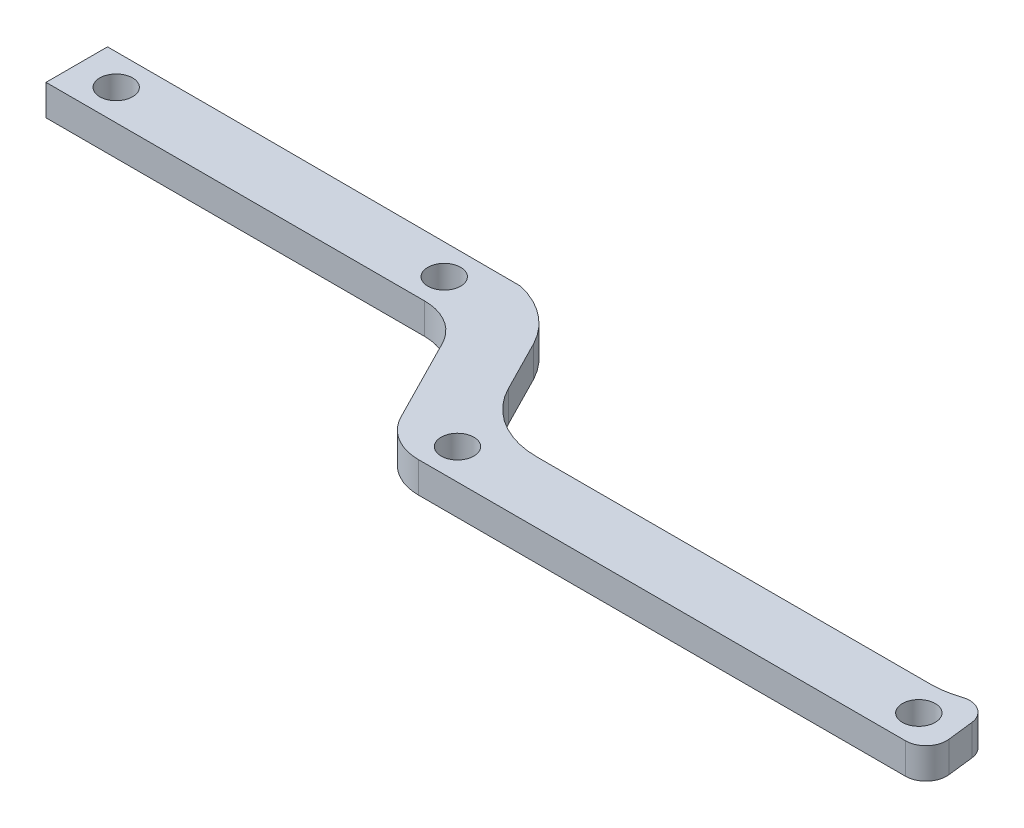
ISO-10303-21;
HEADER;
FILE_DESCRIPTION(('STEP AP214'),'2;1');
FILE_NAME('part.step','',(''),(''),'','','');
FILE_SCHEMA(('AUTOMOTIVE_DESIGN { 1 0 10303 214 1 1 1 1 }'));
ENDSEC;
DATA;
#1=APPLICATION_CONTEXT('core data for automotive mechanical design processes');
#2=APPLICATION_PROTOCOL_DEFINITION('international standard','automotive_design',2000,#1);
#3=PRODUCT_CONTEXT('',#1,'mechanical');
#4=PRODUCT('Part','Part','',(#3));
#5=PRODUCT_RELATED_PRODUCT_CATEGORY('part','',(#4));
#6=PRODUCT_DEFINITION_FORMATION('','',#4);
#7=PRODUCT_DEFINITION_CONTEXT('part definition',#1,'design');
#8=PRODUCT_DEFINITION('design','',#6,#7);
#9=PRODUCT_DEFINITION_SHAPE('','',#8);
#10=(LENGTH_UNIT() NAMED_UNIT(*) SI_UNIT(.MILLI.,.METRE.));
#11=(NAMED_UNIT(*) PLANE_ANGLE_UNIT() SI_UNIT($,.RADIAN.));
#12=(NAMED_UNIT(*) SI_UNIT($,.STERADIAN.) SOLID_ANGLE_UNIT());
#13=UNCERTAINTY_MEASURE_WITH_UNIT(LENGTH_MEASURE(1.E-05),#10,'distance_accuracy_value','');
#14=(GEOMETRIC_REPRESENTATION_CONTEXT(3) GLOBAL_UNCERTAINTY_ASSIGNED_CONTEXT((#13)) GLOBAL_UNIT_ASSIGNED_CONTEXT((#10,
#11,#12)) REPRESENTATION_CONTEXT('',''));
#15=CARTESIAN_POINT('',(0.,0.,0.));
#16=DIRECTION('',(0.,0.,1.));
#17=DIRECTION('',(1.,0.,0.));
#18=AXIS2_PLACEMENT_3D('',#15,#16,#17);
#19=CARTESIAN_POINT('',(-9.79982738187244,3.,48.7042065669143));
#20=DIRECTION('',(0.,-1.,0.));
#21=DIRECTION('',(0.,0.,-1.));
#22=AXIS2_PLACEMENT_3D('',#19,#20,#21);
#23=PLANE('',#22);
#24=CARTESIAN_POINT('',(-56.,3.,37.));
#25=DIRECTION('',(0.,1.,0.));
#26=DIRECTION('',(0.,0.,1.));
#27=AXIS2_PLACEMENT_3D('',#24,#25,#26);
#28=CIRCLE('',#27,1.60000000000001);
#29=CARTESIAN_POINT('',(-56.,3.,38.6));
#30=VERTEX_POINT('',#29);
#31=EDGE_CURVE('E304',#30,#30,#28,.T.);
#32=ORIENTED_EDGE('',*,*,#31,.F.);
#33=EDGE_LOOP('',(#32));
#34=FACE_BOUND('',#33,.T.);
#35=CARTESIAN_POINT('',(-24.,3.,37.));
#36=DIRECTION('',(0.,1.,0.));
#37=DIRECTION('',(0.,0.,1.));
#38=AXIS2_PLACEMENT_3D('',#35,#36,#37);
#39=CIRCLE('',#38,1.6);
#40=CARTESIAN_POINT('',(-24.,3.,38.6));
#41=VERTEX_POINT('',#40);
#42=EDGE_CURVE('E196',#41,#41,#39,.T.);
#43=ORIENTED_EDGE('',*,*,#42,.F.);
#44=EDGE_LOOP('',(#43));
#45=FACE_BOUND('',#44,.T.);
#46=DIRECTION('',(1.,0.,0.));
#47=VECTOR('',#46,1.);
#48=CARTESIAN_POINT('',(-9.79982738187244,3.,53.7042065669143));
#49=LINE('',#48,#47);
#50=CARTESIAN_POINT('',(-9.79982738187244,3.,53.7042065669143));
#51=VERTEX_POINT('',#50);
#52=CARTESIAN_POINT('',(37.7050891937323,3.,53.7042065669143));
#53=VERTEX_POINT('',#52);
#54=EDGE_CURVE('E190',#51,#53,#49,.T.);
#55=ORIENTED_EDGE('',*,*,#54,.T.);
#56=CARTESIAN_POINT('',(37.7050891937323,3.,51.7042065669143));
#57=DIRECTION('',(0.,-1.,0.));
#58=DIRECTION('',(0.,0.,-1.));
#59=AXIS2_PLACEMENT_3D('',#56,#57,#58);
#60=CIRCLE('',#59,2.);
#61=CARTESIAN_POINT('',(39.6914220712851,3.,51.4707934148579));
#62=VERTEX_POINT('',#61);
#63=EDGE_CURVE('E221',#53,#62,#60,.F.);
#64=ORIENTED_EDGE('',*,*,#63,.T.);
#65=DIRECTION('',(0.116706576028239,0.,0.993166438776384));
#66=VECTOR('',#65,1.);
#67=CARTESIAN_POINT('',(39.9148413215952,3.,53.3720787471503));
#68=LINE('',#67,#66);
#69=CARTESIAN_POINT('',(39.3927079930836,3.,48.9287533057557));
#70=VERTEX_POINT('',#69);
#71=EDGE_CURVE('E244',#70,#62,#68,.T.);
#72=ORIENTED_EDGE('',*,*,#71,.F.);
#73=CARTESIAN_POINT('',(37.4063751155308,3.,49.1621664578122));
#74=DIRECTION('',(0.,-1.,0.));
#75=DIRECTION('',(0.,0.,-1.));
#76=AXIS2_PLACEMENT_3D('',#73,#74,#75);
#77=CIRCLE('',#76,2.);
#78=CARTESIAN_POINT('',(36.7582656155353,3.,47.2700898007987));
#79=VERTEX_POINT('',#78);
#80=EDGE_CURVE('E219',#70,#79,#77,.F.);
#81=ORIENTED_EDGE('',*,*,#80,.T.);
#82=CARTESIAN_POINT('',(34.1658276155532,3.,39.7017831727445));
#83=DIRECTION('',(0.,1.,0.));
#84=DIRECTION('',(0.,0.,-1.));
#85=AXIS2_PLACEMENT_3D('',#82,#83,#84);
#86=CIRCLE('',#85,8.00000000000001);
#87=CARTESIAN_POINT('',(34.1658276155532,3.,47.7017831727445));
#88=VERTEX_POINT('',#87);
#89=EDGE_CURVE('E281',#88,#79,#86,.T.);
#90=ORIENTED_EDGE('',*,*,#89,.F.);
#91=DIRECTION('',(1.,0.,0.));
#92=VECTOR('',#91,1.);
#93=CARTESIAN_POINT('',(-4.28585506961672,3.,47.7017831727445));
#94=LINE('',#93,#92);
#95=CARTESIAN_POINT('',(-4.28585506961672,3.,47.7017831727445));
#96=VERTEX_POINT('',#95);
#97=EDGE_CURVE('E279',#96,#88,#94,.T.);
#98=ORIENTED_EDGE('',*,*,#97,.F.);
#99=CARTESIAN_POINT('',(-4.28585506961672,3.,39.7017831727445));
#100=DIRECTION('',(0.,1.,0.));
#101=DIRECTION('',(0.,0.,-1.));
#102=AXIS2_PLACEMENT_3D('',#99,#100,#101);
#103=CIRCLE('',#102,8.);
#104=CARTESIAN_POINT('',(-11.4139072631237,3.,43.3337071706608));
#105=VERTEX_POINT('',#104);
#106=EDGE_CURVE('E277',#105,#96,#103,.T.);
#107=ORIENTED_EDGE('',*,*,#106,.F.);
#108=DIRECTION('',(0.453990499739546,0.,0.891006524188369));
#109=VECTOR('',#108,1.);
#110=CARTESIAN_POINT('',(-13.9886798018229,3.,38.2804315369236));
#111=LINE('',#110,#109);
#112=CARTESIAN_POINT('',(-13.9886798018229,3.,38.2804315369236));
#113=VERTEX_POINT('',#112);
#114=EDGE_CURVE('E274',#113,#105,#111,.T.);
#115=ORIENTED_EDGE('',*,*,#114,.F.);
#116=CARTESIAN_POINT('',(-21.3285940819915,3.,42.1767169110995));
#117=DIRECTION('',(0.,-1.,0.));
#118=DIRECTION('',(0.,0.,-1.));
#119=AXIS2_PLACEMENT_3D('',#116,#117,#118);
#120=CIRCLE('',#119,8.3099567602509);
#121=CARTESIAN_POINT('',(-19.5007730607667,3.,34.0702718411808));
#122=VERTEX_POINT('',#121);
#123=EDGE_CURVE('E272',#122,#113,#120,.T.);
#124=ORIENTED_EDGE('',*,*,#123,.F.);
#125=DIRECTION('',(0.99999716270001,0.,0.00238214019950525));
#126=VECTOR('',#125,1.);
#127=CARTESIAN_POINT('',(-49.0001458571761,3.,34.));
#128=LINE('',#127,#126);
#129=CARTESIAN_POINT('',(-49.0001458571761,3.,34.));
#130=VERTEX_POINT('',#129);
#131=EDGE_CURVE('E170',#130,#122,#128,.T.);
#132=ORIENTED_EDGE('',*,*,#131,.F.);
#133=DIRECTION('',(1.,0.,0.));
#134=VECTOR('',#133,1.);
#135=CARTESIAN_POINT('',(-59.8464733335436,3.,34.));
#136=LINE('',#135,#134);
#137=CARTESIAN_POINT('',(-59.8464733335436,3.,34.));
#138=VERTEX_POINT('',#137);
#139=EDGE_CURVE('E153',#138,#130,#136,.T.);
#140=ORIENTED_EDGE('',*,*,#139,.F.);
#141=DIRECTION('',(0.,0.,1.));
#142=VECTOR('',#141,1.);
#143=CARTESIAN_POINT('',(-59.8464733335436,3.,34.));
#144=LINE('',#143,#142);
#145=CARTESIAN_POINT('',(-59.8464733335436,3.,40.));
#146=VERTEX_POINT('',#145);
#147=EDGE_CURVE('E167',#138,#146,#144,.T.);
#148=ORIENTED_EDGE('',*,*,#147,.T.);
#149=DIRECTION('',(1.,0.,0.));
#150=VECTOR('',#149,1.);
#151=CARTESIAN_POINT('',(-59.8464733335436,3.,40.));
#152=LINE('',#151,#150);
#153=CARTESIAN_POINT('',(-22.9104772742433,3.,40.));
#154=VERTEX_POINT('',#153);
#155=EDGE_CURVE('E175',#146,#154,#152,.T.);
#156=ORIENTED_EDGE('',*,*,#155,.T.);
#157=CARTESIAN_POINT('',(-22.9104772742433,3.,45.));
#158=DIRECTION('',(0.,-1.,0.));
#159=DIRECTION('',(0.,0.,-1.));
#160=AXIS2_PLACEMENT_3D('',#157,#158,#159);
#161=CIRCLE('',#160,5.);
#162=CARTESIAN_POINT('',(-18.4554446533014,3.,42.7300475013023));
#163=VERTEX_POINT('',#162);
#164=EDGE_CURVE('E214',#154,#163,#161,.T.);
#165=ORIENTED_EDGE('',*,*,#164,.T.);
#166=DIRECTION('',(0.453990499739545,0.,0.891006524188369));
#167=VECTOR('',#166,1.);
#168=CARTESIAN_POINT('',(-19.8464733335436,3.,40.));
#169=LINE('',#168,#167);
#170=CARTESIAN_POINT('',(-14.2548600028143,3.,50.9741590656121));
#171=VERTEX_POINT('',#170);
#172=EDGE_CURVE('E178',#163,#171,#169,.T.);
#173=ORIENTED_EDGE('',*,*,#172,.T.);
#174=CARTESIAN_POINT('',(-9.79982738187244,3.,48.7042065669143));
#175=DIRECTION('',(0.,1.,0.));
#176=DIRECTION('',(0.,0.,-1.));
#177=AXIS2_PLACEMENT_3D('',#174,#175,#176);
#178=CIRCLE('',#177,5.);
#179=EDGE_CURVE('E188',#171,#51,#178,.T.);
#180=ORIENTED_EDGE('',*,*,#179,.T.);
#181=EDGE_LOOP('',(#55,#64,#72,#81,#90,#98,#107,#115,#124,#132,#140,#148,#156,#165,#173,#180));
#182=FACE_BOUND('',#181,.T.);
#183=CARTESIAN_POINT('',(-8.99999999999999,3.,50.7042065669143));
#184=DIRECTION('',(0.,1.,0.));
#185=DIRECTION('',(0.,0.,1.));
#186=AXIS2_PLACEMENT_3D('',#183,#184,#185);
#187=CIRCLE('',#186,1.59999999999999);
#188=CARTESIAN_POINT('',(-8.99999999999999,3.,52.3042065669143));
#189=VERTEX_POINT('',#188);
#190=EDGE_CURVE('E266',#189,#189,#187,.T.);
#191=ORIENTED_EDGE('',*,*,#190,.F.);
#192=EDGE_LOOP('',(#191));
#193=FACE_BOUND('',#192,.T.);
#194=CARTESIAN_POINT('',(36.,3.,50.7042065669143));
#195=DIRECTION('',(0.,1.,0.));
#196=DIRECTION('',(0.,0.,1.));
#197=AXIS2_PLACEMENT_3D('',#194,#195,#196);
#198=CIRCLE('',#197,1.6);
#199=CARTESIAN_POINT('',(36.,3.,52.3042065669143));
#200=VERTEX_POINT('',#199);
#201=EDGE_CURVE('E260',#200,#200,#198,.T.);
#202=ORIENTED_EDGE('',*,*,#201,.F.);
#203=EDGE_LOOP('',(#202));
#204=FACE_BOUND('',#203,.T.);
#205=ADVANCED_FACE('F35',(#34,#45,#182,#193,#204),#23,.F.);
#206=CARTESIAN_POINT('',(-9.79982738187244,0.,48.7042065669143));
#207=DIRECTION('',(0.,-1.,0.));
#208=DIRECTION('',(0.,0.,-1.));
#209=AXIS2_PLACEMENT_3D('',#206,#207,#208);
#210=PLANE('',#209);
#211=DIRECTION('',(-0.116706576028239,0.,-0.993166438776384));
#212=VECTOR('',#211,1.);
#213=CARTESIAN_POINT('',(38.6966577597579,0.,43.0054047253447));
#214=LINE('',#213,#212);
#215=CARTESIAN_POINT('',(39.6914220712851,0.,51.4707934148579));
#216=VERTEX_POINT('',#215);
#217=CARTESIAN_POINT('',(39.3927079930836,0.,48.9287533057557));
#218=VERTEX_POINT('',#217);
#219=EDGE_CURVE('E233',#216,#218,#214,.T.);
#220=ORIENTED_EDGE('',*,*,#219,.F.);
#221=CARTESIAN_POINT('',(37.7050891937323,0.,51.7042065669143));
#222=DIRECTION('',(0.,-1.,0.));
#223=DIRECTION('',(0.,0.,-1.));
#224=AXIS2_PLACEMENT_3D('',#221,#222,#223);
#225=CIRCLE('',#224,2.);
#226=CARTESIAN_POINT('',(37.7050891937323,0.,53.7042065669143));
#227=VERTEX_POINT('',#226);
#228=EDGE_CURVE('E43',#216,#227,#225,.T.);
#229=ORIENTED_EDGE('',*,*,#228,.T.);
#230=DIRECTION('',(1.,0.,0.));
#231=VECTOR('',#230,1.);
#232=CARTESIAN_POINT('',(-9.79982738187244,0.,53.7042065669143));
#233=LINE('',#232,#231);
#234=CARTESIAN_POINT('',(-9.79982738187244,0.,53.7042065669143));
#235=VERTEX_POINT('',#234);
#236=EDGE_CURVE('E176',#235,#227,#233,.T.);
#237=ORIENTED_EDGE('',*,*,#236,.F.);
#238=CARTESIAN_POINT('',(-9.79982738187244,0.,48.7042065669143));
#239=DIRECTION('',(0.,1.,0.));
#240=DIRECTION('',(0.,0.,-1.));
#241=AXIS2_PLACEMENT_3D('',#238,#239,#240);
#242=CIRCLE('',#241,5.);
#243=CARTESIAN_POINT('',(-14.2548600028143,0.,50.9741590656121));
#244=VERTEX_POINT('',#243);
#245=EDGE_CURVE('E181',#244,#235,#242,.T.);
#246=ORIENTED_EDGE('',*,*,#245,.F.);
#247=DIRECTION('',(0.453990499739545,0.,0.891006524188369));
#248=VECTOR('',#247,1.);
#249=CARTESIAN_POINT('',(-19.8464733335436,0.,40.));
#250=LINE('',#249,#248);
#251=CARTESIAN_POINT('',(-18.4554446533014,0.,42.7300475013023));
#252=VERTEX_POINT('',#251);
#253=EDGE_CURVE('E199',#252,#244,#250,.T.);
#254=ORIENTED_EDGE('',*,*,#253,.F.);
#255=CARTESIAN_POINT('',(-22.9104772742433,0.,45.));
#256=DIRECTION('',(0.,-1.,0.));
#257=DIRECTION('',(0.,0.,-1.));
#258=AXIS2_PLACEMENT_3D('',#255,#256,#257);
#259=CIRCLE('',#258,5.);
#260=CARTESIAN_POINT('',(-22.9104772742433,0.,40.));
#261=VERTEX_POINT('',#260);
#262=EDGE_CURVE('E212',#252,#261,#259,.F.);
#263=ORIENTED_EDGE('',*,*,#262,.T.);
#264=DIRECTION('',(1.,0.,0.));
#265=VECTOR('',#264,1.);
#266=CARTESIAN_POINT('',(-59.8464733335436,0.,40.));
#267=LINE('',#266,#265);
#268=CARTESIAN_POINT('',(-59.8464733335436,0.,40.));
#269=VERTEX_POINT('',#268);
#270=EDGE_CURVE('E195',#269,#261,#267,.T.);
#271=ORIENTED_EDGE('',*,*,#270,.F.);
#272=DIRECTION('',(0.,0.,1.));
#273=VECTOR('',#272,1.);
#274=CARTESIAN_POINT('',(-59.8464733335436,0.,34.));
#275=LINE('',#274,#273);
#276=CARTESIAN_POINT('',(-59.8464733335436,0.,34.));
#277=VERTEX_POINT('',#276);
#278=EDGE_CURVE('E193',#277,#269,#275,.T.);
#279=ORIENTED_EDGE('',*,*,#278,.F.);
#280=DIRECTION('',(-1.,0.,0.));
#281=VECTOR('',#280,1.);
#282=CARTESIAN_POINT('',(-9.79982738187244,0.,34.));
#283=LINE('',#282,#281);
#284=CARTESIAN_POINT('',(-49.0001458571761,0.,34.));
#285=VERTEX_POINT('',#284);
#286=EDGE_CURVE('E156',#285,#277,#283,.T.);
#287=ORIENTED_EDGE('',*,*,#286,.F.);
#288=DIRECTION('',(-0.99999716270001,0.,-0.00238214019950525));
#289=VECTOR('',#288,1.);
#290=CARTESIAN_POINT('',(-9.76502244550191,0.,34.0934638298964));
#291=LINE('',#290,#289);
#292=CARTESIAN_POINT('',(-19.5007730607667,0.,34.0702718411808));
#293=VERTEX_POINT('',#292);
#294=EDGE_CURVE('E255',#293,#285,#291,.T.);
#295=ORIENTED_EDGE('',*,*,#294,.F.);
#296=CARTESIAN_POINT('',(-21.3285940819915,0.,42.1767169110995));
#297=DIRECTION('',(0.,-1.,0.));
#298=DIRECTION('',(0.,0.,-1.));
#299=AXIS2_PLACEMENT_3D('',#296,#297,#298);
#300=CIRCLE('',#299,8.3099567602509);
#301=CARTESIAN_POINT('',(-13.9886798018229,0.,38.2804315369236));
#302=VERTEX_POINT('',#301);
#303=EDGE_CURVE('E269',#293,#302,#300,.T.);
#304=ORIENTED_EDGE('',*,*,#303,.T.);
#305=DIRECTION('',(0.453990499739546,0.,0.891006524188369));
#306=VECTOR('',#305,1.);
#307=CARTESIAN_POINT('',(-13.9886798018229,0.,38.2804315369236));
#308=LINE('',#307,#306);
#309=CARTESIAN_POINT('',(-11.4139072631237,0.,43.3337071706608));
#310=VERTEX_POINT('',#309);
#311=EDGE_CURVE('E285',#302,#310,#308,.T.);
#312=ORIENTED_EDGE('',*,*,#311,.T.);
#313=CARTESIAN_POINT('',(-4.28585506961672,0.,39.7017831727445));
#314=DIRECTION('',(0.,1.,0.));
#315=DIRECTION('',(0.,0.,-1.));
#316=AXIS2_PLACEMENT_3D('',#313,#314,#315);
#317=CIRCLE('',#316,8.);
#318=CARTESIAN_POINT('',(-4.28585506961672,0.,47.7017831727445));
#319=VERTEX_POINT('',#318);
#320=EDGE_CURVE('E288',#310,#319,#317,.T.);
#321=ORIENTED_EDGE('',*,*,#320,.T.);
#322=DIRECTION('',(1.,0.,0.));
#323=VECTOR('',#322,1.);
#324=CARTESIAN_POINT('',(-4.28585506961672,0.,47.7017831727445));
#325=LINE('',#324,#323);
#326=CARTESIAN_POINT('',(34.1658276155532,0.,47.7017831727445));
#327=VERTEX_POINT('',#326);
#328=EDGE_CURVE('E291',#319,#327,#325,.T.);
#329=ORIENTED_EDGE('',*,*,#328,.T.);
#330=CARTESIAN_POINT('',(34.1658276155532,0.,39.7017831727445));
#331=DIRECTION('',(0.,1.,0.));
#332=DIRECTION('',(0.,0.,-1.));
#333=AXIS2_PLACEMENT_3D('',#330,#331,#332);
#334=CIRCLE('',#333,8.00000000000001);
#335=CARTESIAN_POINT('',(36.7582656155353,0.,47.2700898007987));
#336=VERTEX_POINT('',#335);
#337=EDGE_CURVE('E275',#327,#336,#334,.T.);
#338=ORIENTED_EDGE('',*,*,#337,.T.);
#339=CARTESIAN_POINT('',(37.4063751155308,0.,49.1621664578122));
#340=DIRECTION('',(0.,-1.,0.));
#341=DIRECTION('',(0.,0.,-1.));
#342=AXIS2_PLACEMENT_3D('',#339,#340,#341);
#343=CIRCLE('',#342,2.);
#344=EDGE_CURVE('E55',#336,#218,#343,.T.);
#345=ORIENTED_EDGE('',*,*,#344,.T.);
#346=EDGE_LOOP('',(#220,#229,#237,#246,#254,#263,#271,#279,#287,#295,#304,#312,#321,#329,#338,#345));
#347=FACE_BOUND('',#346,.T.);
#348=CARTESIAN_POINT('',(36.,0.,50.7042065669143));
#349=DIRECTION('',(0.,1.,0.));
#350=DIRECTION('',(0.,0.,1.));
#351=AXIS2_PLACEMENT_3D('',#348,#349,#350);
#352=CIRCLE('',#351,1.6);
#353=CARTESIAN_POINT('',(36.,0.,52.3042065669143));
#354=VERTEX_POINT('',#353);
#355=EDGE_CURVE('E259',#354,#354,#352,.T.);
#356=ORIENTED_EDGE('',*,*,#355,.T.);
#357=EDGE_LOOP('',(#356));
#358=FACE_BOUND('',#357,.T.);
#359=CARTESIAN_POINT('',(-56.,0.,37.));
#360=DIRECTION('',(0.,1.,0.));
#361=DIRECTION('',(0.,0.,1.));
#362=AXIS2_PLACEMENT_3D('',#359,#360,#361);
#363=CIRCLE('',#362,1.60000000000001);
#364=CARTESIAN_POINT('',(-56.,0.,38.6));
#365=VERTEX_POINT('',#364);
#366=EDGE_CURVE('E303',#365,#365,#363,.T.);
#367=ORIENTED_EDGE('',*,*,#366,.T.);
#368=EDGE_LOOP('',(#367));
#369=FACE_BOUND('',#368,.T.);
#370=CARTESIAN_POINT('',(-24.,0.,37.));
#371=DIRECTION('',(0.,1.,0.));
#372=DIRECTION('',(0.,0.,1.));
#373=AXIS2_PLACEMENT_3D('',#370,#371,#372);
#374=CIRCLE('',#373,1.6);
#375=CARTESIAN_POINT('',(-24.,0.,38.6));
#376=VERTEX_POINT('',#375);
#377=EDGE_CURVE('E184',#376,#376,#374,.T.);
#378=ORIENTED_EDGE('',*,*,#377,.T.);
#379=EDGE_LOOP('',(#378));
#380=FACE_BOUND('',#379,.T.);
#381=CARTESIAN_POINT('',(-8.99999999999999,0.,50.7042065669143));
#382=DIRECTION('',(0.,1.,0.));
#383=DIRECTION('',(0.,0.,1.));
#384=AXIS2_PLACEMENT_3D('',#381,#382,#383);
#385=CIRCLE('',#384,1.59999999999999);
#386=CARTESIAN_POINT('',(-8.99999999999999,0.,52.3042065669143));
#387=VERTEX_POINT('',#386);
#388=EDGE_CURVE('E263',#387,#387,#385,.T.);
#389=ORIENTED_EDGE('',*,*,#388,.T.);
#390=EDGE_LOOP('',(#389));
#391=FACE_BOUND('',#390,.T.);
#392=ADVANCED_FACE('F230',(#347,#358,#369,#380,#391),#210,.T.);
#393=CARTESIAN_POINT('',(-59.8464733335436,3.,34.));
#394=DIRECTION('',(1.,0.,0.));
#395=DIRECTION('',(0.,0.,-1.));
#396=AXIS2_PLACEMENT_3D('',#393,#394,#395);
#397=PLANE('',#396);
#398=ORIENTED_EDGE('',*,*,#278,.T.);
#399=DIRECTION('',(0.,-1.,0.));
#400=VECTOR('',#399,1.);
#401=CARTESIAN_POINT('',(-59.8464733335436,3.,40.));
#402=LINE('',#401,#400);
#403=EDGE_CURVE('E161',#146,#269,#402,.T.);
#404=ORIENTED_EDGE('',*,*,#403,.F.);
#405=ORIENTED_EDGE('',*,*,#147,.F.);
#406=DIRECTION('',(0.,-1.,0.));
#407=VECTOR('',#406,1.);
#408=CARTESIAN_POINT('',(-59.8464733335436,3.,34.));
#409=LINE('',#408,#407);
#410=EDGE_CURVE('E149',#138,#277,#409,.T.);
#411=ORIENTED_EDGE('',*,*,#410,.T.);
#412=EDGE_LOOP('',(#398,#404,#405,#411));
#413=FACE_BOUND('',#412,.T.);
#414=ADVANCED_FACE('F172',(#413),#397,.F.);
#415=CARTESIAN_POINT('',(-59.8464733335436,3.,40.));
#416=DIRECTION('',(0.,0.,-1.));
#417=DIRECTION('',(-1.,0.,0.));
#418=AXIS2_PLACEMENT_3D('',#415,#416,#417);
#419=PLANE('',#418);
#420=ORIENTED_EDGE('',*,*,#270,.T.);
#421=DIRECTION('',(0.,-1.,0.));
#422=VECTOR('',#421,1.);
#423=CARTESIAN_POINT('',(-22.9104772742433,3.,40.));
#424=LINE('',#423,#422);
#425=EDGE_CURVE('E210',#261,#154,#424,.F.);
#426=ORIENTED_EDGE('',*,*,#425,.T.);
#427=ORIENTED_EDGE('',*,*,#155,.F.);
#428=ORIENTED_EDGE('',*,*,#403,.T.);
#429=EDGE_LOOP('',(#420,#426,#427,#428));
#430=FACE_BOUND('',#429,.T.);
#431=ADVANCED_FACE('F345',(#430),#419,.F.);
#432=CARTESIAN_POINT('',(-19.8464733335436,3.,40.));
#433=DIRECTION('',(0.891006524188369,0.,-0.453990499739545));
#434=DIRECTION('',(-0.453990499739545,0.,-0.891006524188369));
#435=AXIS2_PLACEMENT_3D('',#432,#433,#434);
#436=PLANE('',#435);
#437=ORIENTED_EDGE('',*,*,#172,.F.);
#438=DIRECTION('',(0.,-1.,0.));
#439=VECTOR('',#438,1.);
#440=CARTESIAN_POINT('',(-18.4554446533014,0.,42.7300475013023));
#441=LINE('',#440,#439);
#442=EDGE_CURVE('E160',#163,#252,#441,.T.);
#443=ORIENTED_EDGE('',*,*,#442,.T.);
#444=ORIENTED_EDGE('',*,*,#253,.T.);
#445=DIRECTION('',(0.,-1.,0.));
#446=VECTOR('',#445,1.);
#447=CARTESIAN_POINT('',(-14.2548600028143,3.,50.9741590656121));
#448=LINE('',#447,#446);
#449=EDGE_CURVE('E204',#171,#244,#448,.T.);
#450=ORIENTED_EDGE('',*,*,#449,.F.);
#451=EDGE_LOOP('',(#437,#443,#444,#450));
#452=FACE_BOUND('',#451,.T.);
#453=ADVANCED_FACE('F341',(#452),#436,.F.);
#454=CARTESIAN_POINT('',(-9.79982738187244,3.,48.7042065669143));
#455=DIRECTION('',(0.,-1.,0.));
#456=DIRECTION('',(0.,0.,-1.));
#457=AXIS2_PLACEMENT_3D('',#454,#455,#456);
#458=CYLINDRICAL_SURFACE('',#457,5.);
#459=ORIENTED_EDGE('',*,*,#245,.T.);
#460=DIRECTION('',(0.,-1.,0.));
#461=VECTOR('',#460,1.);
#462=CARTESIAN_POINT('',(-9.79982738187244,3.,53.7042065669143));
#463=LINE('',#462,#461);
#464=EDGE_CURVE('E192',#51,#235,#463,.T.);
#465=ORIENTED_EDGE('',*,*,#464,.F.);
#466=ORIENTED_EDGE('',*,*,#179,.F.);
#467=ORIENTED_EDGE('',*,*,#449,.T.);
#468=EDGE_LOOP('',(#459,#465,#466,#467));
#469=FACE_BOUND('',#468,.T.);
#470=ADVANCED_FACE('F327',(#469),#458,.T.);
#471=CARTESIAN_POINT('',(-9.79982738187244,3.,53.7042065669143));
#472=DIRECTION('',(0.,0.,-1.));
#473=DIRECTION('',(-1.,0.,0.));
#474=AXIS2_PLACEMENT_3D('',#471,#472,#473);
#475=PLANE('',#474);
#476=ORIENTED_EDGE('',*,*,#236,.T.);
#477=DIRECTION('',(0.,1.,0.));
#478=VECTOR('',#477,1.);
#479=CARTESIAN_POINT('',(37.7050891937323,3.,53.7042065669143));
#480=LINE('',#479,#478);
#481=EDGE_CURVE('E216',#227,#53,#480,.T.);
#482=ORIENTED_EDGE('',*,*,#481,.T.);
#483=ORIENTED_EDGE('',*,*,#54,.F.);
#484=ORIENTED_EDGE('',*,*,#464,.T.);
#485=EDGE_LOOP('',(#476,#482,#483,#484));
#486=FACE_BOUND('',#485,.T.);
#487=ADVANCED_FACE('F238',(#486),#475,.F.);
#488=CARTESIAN_POINT('',(-24.,3.,37.));
#489=DIRECTION('',(0.,-1.,0.));
#490=DIRECTION('',(0.,0.,-1.));
#491=AXIS2_PLACEMENT_3D('',#488,#489,#490);
#492=CYLINDRICAL_SURFACE('',#491,1.6);
#493=ORIENTED_EDGE('',*,*,#42,.T.);
#494=EDGE_LOOP('',(#493));
#495=FACE_BOUND('',#494,.T.);
#496=ORIENTED_EDGE('',*,*,#377,.F.);
#497=EDGE_LOOP('',(#496));
#498=FACE_BOUND('',#497,.T.);
#499=ADVANCED_FACE('F316',(#495,#498),#492,.F.);
#500=CARTESIAN_POINT('',(-56.,3.,37.));
#501=DIRECTION('',(0.,-1.,0.));
#502=DIRECTION('',(0.,0.,-1.));
#503=AXIS2_PLACEMENT_3D('',#500,#501,#502);
#504=CYLINDRICAL_SURFACE('',#503,1.60000000000001);
#505=ORIENTED_EDGE('',*,*,#31,.T.);
#506=EDGE_LOOP('',(#505));
#507=FACE_BOUND('',#506,.T.);
#508=ORIENTED_EDGE('',*,*,#366,.F.);
#509=EDGE_LOOP('',(#508));
#510=FACE_BOUND('',#509,.T.);
#511=ADVANCED_FACE('F318',(#507,#510),#504,.F.);
#512=CARTESIAN_POINT('',(-21.3285940819915,3.,42.1767169110995));
#513=DIRECTION('',(0.,-1.,0.));
#514=DIRECTION('',(0.,0.,-1.));
#515=AXIS2_PLACEMENT_3D('',#512,#513,#514);
#516=CYLINDRICAL_SURFACE('',#515,8.3099567602509);
#517=DIRECTION('',(0.,-1.,0.));
#518=VECTOR('',#517,1.);
#519=CARTESIAN_POINT('',(-19.5007730607667,3.,34.0702718411808));
#520=LINE('',#519,#518);
#521=EDGE_CURVE('E250',#122,#293,#520,.T.);
#522=ORIENTED_EDGE('',*,*,#521,.F.);
#523=ORIENTED_EDGE('',*,*,#123,.T.);
#524=DIRECTION('',(0.,-1.,0.));
#525=VECTOR('',#524,1.);
#526=CARTESIAN_POINT('',(-13.9886798018229,3.,38.2804315369236));
#527=LINE('',#526,#525);
#528=EDGE_CURVE('E300',#113,#302,#527,.T.);
#529=ORIENTED_EDGE('',*,*,#528,.T.);
#530=ORIENTED_EDGE('',*,*,#303,.F.);
#531=EDGE_LOOP('',(#522,#523,#529,#530));
#532=FACE_BOUND('',#531,.T.);
#533=ADVANCED_FACE('F324',(#532),#516,.T.);
#534=CARTESIAN_POINT('',(-13.9886798018229,3.,38.2804315369236));
#535=DIRECTION('',(0.891006524188368,0.,-0.453990499739546));
#536=DIRECTION('',(-0.453990499739546,0.,-0.891006524188369));
#537=AXIS2_PLACEMENT_3D('',#534,#535,#536);
#538=PLANE('',#537);
#539=ORIENTED_EDGE('',*,*,#311,.F.);
#540=ORIENTED_EDGE('',*,*,#528,.F.);
#541=ORIENTED_EDGE('',*,*,#114,.T.);
#542=DIRECTION('',(0.,-1.,0.));
#543=VECTOR('',#542,1.);
#544=CARTESIAN_POINT('',(-11.4139072631237,3.,43.3337071706608));
#545=LINE('',#544,#543);
#546=EDGE_CURVE('E298',#105,#310,#545,.T.);
#547=ORIENTED_EDGE('',*,*,#546,.T.);
#548=EDGE_LOOP('',(#539,#540,#541,#547));
#549=FACE_BOUND('',#548,.T.);
#550=ADVANCED_FACE('F388',(#549),#538,.T.);
#551=CARTESIAN_POINT('',(-4.28585506961672,3.,39.7017831727445));
#552=DIRECTION('',(0.,-1.,0.));
#553=DIRECTION('',(0.,0.,-1.));
#554=AXIS2_PLACEMENT_3D('',#551,#552,#553);
#555=CYLINDRICAL_SURFACE('',#554,8.);
#556=ORIENTED_EDGE('',*,*,#320,.F.);
#557=ORIENTED_EDGE('',*,*,#546,.F.);
#558=ORIENTED_EDGE('',*,*,#106,.T.);
#559=DIRECTION('',(0.,-1.,0.));
#560=VECTOR('',#559,1.);
#561=CARTESIAN_POINT('',(-4.28585506961672,3.,47.7017831727445));
#562=LINE('',#561,#560);
#563=EDGE_CURVE('E296',#96,#319,#562,.T.);
#564=ORIENTED_EDGE('',*,*,#563,.T.);
#565=EDGE_LOOP('',(#556,#557,#558,#564));
#566=FACE_BOUND('',#565,.T.);
#567=ADVANCED_FACE('F384',(#566),#555,.F.);
#568=CARTESIAN_POINT('',(-4.28585506961672,3.,47.7017831727445));
#569=DIRECTION('',(0.,0.,-1.));
#570=DIRECTION('',(-1.,0.,0.));
#571=AXIS2_PLACEMENT_3D('',#568,#569,#570);
#572=PLANE('',#571);
#573=ORIENTED_EDGE('',*,*,#328,.F.);
#574=ORIENTED_EDGE('',*,*,#563,.F.);
#575=ORIENTED_EDGE('',*,*,#97,.T.);
#576=DIRECTION('',(0.,-1.,0.));
#577=VECTOR('',#576,1.);
#578=CARTESIAN_POINT('',(34.1658276155532,3.,47.7017831727445));
#579=LINE('',#578,#577);
#580=EDGE_CURVE('E283',#88,#327,#579,.T.);
#581=ORIENTED_EDGE('',*,*,#580,.T.);
#582=EDGE_LOOP('',(#573,#574,#575,#581));
#583=FACE_BOUND('',#582,.T.);
#584=ADVANCED_FACE('F381',(#583),#572,.T.);
#585=CARTESIAN_POINT('',(34.1658276155532,3.,39.7017831727445));
#586=DIRECTION('',(0.,-1.,0.));
#587=DIRECTION('',(0.,0.,-1.));
#588=AXIS2_PLACEMENT_3D('',#585,#586,#587);
#589=CYLINDRICAL_SURFACE('',#588,8.00000000000001);
#590=ORIENTED_EDGE('',*,*,#89,.T.);
#591=DIRECTION('',(0.,-1.,0.));
#592=VECTOR('',#591,1.);
#593=CARTESIAN_POINT('',(36.7582656155353,3.,47.2700898007987));
#594=LINE('',#593,#592);
#595=EDGE_CURVE('E11',#79,#336,#594,.T.);
#596=ORIENTED_EDGE('',*,*,#595,.T.);
#597=ORIENTED_EDGE('',*,*,#337,.F.);
#598=ORIENTED_EDGE('',*,*,#580,.F.);
#599=EDGE_LOOP('',(#590,#596,#597,#598));
#600=FACE_BOUND('',#599,.T.);
#601=ADVANCED_FACE('F377',(#600),#589,.F.);
#602=CARTESIAN_POINT('',(-8.99999999999999,3.,50.7042065669143));
#603=DIRECTION('',(0.,-1.,0.));
#604=DIRECTION('',(0.,0.,-1.));
#605=AXIS2_PLACEMENT_3D('',#602,#603,#604);
#606=CYLINDRICAL_SURFACE('',#605,1.59999999999999);
#607=ORIENTED_EDGE('',*,*,#190,.T.);
#608=EDGE_LOOP('',(#607));
#609=FACE_BOUND('',#608,.T.);
#610=ORIENTED_EDGE('',*,*,#388,.F.);
#611=EDGE_LOOP('',(#610));
#612=FACE_BOUND('',#611,.T.);
#613=ADVANCED_FACE('F373',(#609,#612),#606,.F.);
#614=CARTESIAN_POINT('',(36.,3.,50.7042065669143));
#615=DIRECTION('',(0.,-1.,0.));
#616=DIRECTION('',(0.,0.,-1.));
#617=AXIS2_PLACEMENT_3D('',#614,#615,#616);
#618=CYLINDRICAL_SURFACE('',#617,1.6);
#619=ORIENTED_EDGE('',*,*,#201,.T.);
#620=EDGE_LOOP('',(#619));
#621=FACE_BOUND('',#620,.T.);
#622=ORIENTED_EDGE('',*,*,#355,.F.);
#623=EDGE_LOOP('',(#622));
#624=FACE_BOUND('',#623,.T.);
#625=ADVANCED_FACE('F354',(#621,#624),#618,.F.);
#626=CARTESIAN_POINT('',(-22.9104772742433,3.,45.));
#627=DIRECTION('',(0.,1.,0.));
#628=DIRECTION('',(0.,0.,1.));
#629=AXIS2_PLACEMENT_3D('',#626,#627,#628);
#630=CYLINDRICAL_SURFACE('',#629,5.);
#631=ORIENTED_EDGE('',*,*,#164,.F.);
#632=ORIENTED_EDGE('',*,*,#425,.F.);
#633=ORIENTED_EDGE('',*,*,#262,.F.);
#634=ORIENTED_EDGE('',*,*,#442,.F.);
#635=EDGE_LOOP('',(#631,#632,#633,#634));
#636=FACE_BOUND('',#635,.T.);
#637=ADVANCED_FACE('F352',(#636),#630,.F.);
#638=CARTESIAN_POINT('',(39.9148413215952,-9.,53.3720787471503));
#639=DIRECTION('',(-0.993166438776384,0.,0.116706576028239));
#640=DIRECTION('',(0.116706576028239,0.,0.993166438776384));
#641=AXIS2_PLACEMENT_3D('',#638,#639,#640);
#642=PLANE('',#641);
#643=ORIENTED_EDGE('',*,*,#71,.T.);
#644=DIRECTION('',(0.,1.,0.));
#645=VECTOR('',#644,1.);
#646=CARTESIAN_POINT('',(39.6914220712851,-9.,51.4707934148579));
#647=LINE('',#646,#645);
#648=EDGE_CURVE('E226',#62,#216,#647,.F.);
#649=ORIENTED_EDGE('',*,*,#648,.T.);
#650=ORIENTED_EDGE('',*,*,#219,.T.);
#651=DIRECTION('',(0.,1.,0.));
#652=VECTOR('',#651,1.);
#653=CARTESIAN_POINT('',(39.3927079930836,3.,48.9287533057557));
#654=LINE('',#653,#652);
#655=EDGE_CURVE('E223',#218,#70,#654,.T.);
#656=ORIENTED_EDGE('',*,*,#655,.T.);
#657=EDGE_LOOP('',(#643,#649,#650,#656));
#658=FACE_BOUND('',#657,.T.);
#659=ADVANCED_FACE('F246',(#658),#642,.F.);
#660=CARTESIAN_POINT('',(-49.0001458571761,-9.,34.));
#661=DIRECTION('',(-0.00238214019950525,0.,0.99999716270001));
#662=DIRECTION('',(0.99999716270001,0.,0.00238214019950525));
#663=AXIS2_PLACEMENT_3D('',#660,#661,#662);
#664=PLANE('',#663);
#665=ORIENTED_EDGE('',*,*,#294,.T.);
#666=DIRECTION('',(0.,1.,0.));
#667=VECTOR('',#666,1.);
#668=CARTESIAN_POINT('',(-49.0001458571761,-9.,34.));
#669=LINE('',#668,#667);
#670=EDGE_CURVE('E248',#285,#130,#669,.T.);
#671=ORIENTED_EDGE('',*,*,#670,.T.);
#672=ORIENTED_EDGE('',*,*,#131,.T.);
#673=ORIENTED_EDGE('',*,*,#521,.T.);
#674=EDGE_LOOP('',(#665,#671,#672,#673));
#675=FACE_BOUND('',#674,.T.);
#676=ADVANCED_FACE('F362',(#675),#664,.F.);
#677=CARTESIAN_POINT('',(-59.8464733335436,-9.,34.));
#678=DIRECTION('',(0.,0.,1.));
#679=DIRECTION('',(1.,0.,0.));
#680=AXIS2_PLACEMENT_3D('',#677,#678,#679);
#681=PLANE('',#680);
#682=ORIENTED_EDGE('',*,*,#286,.T.);
#683=ORIENTED_EDGE('',*,*,#410,.F.);
#684=ORIENTED_EDGE('',*,*,#139,.T.);
#685=ORIENTED_EDGE('',*,*,#670,.F.);
#686=EDGE_LOOP('',(#682,#683,#684,#685));
#687=FACE_BOUND('',#686,.T.);
#688=ADVANCED_FACE('F151',(#687),#681,.F.);
#689=CARTESIAN_POINT('',(37.7050891937323,3.,51.7042065669143));
#690=DIRECTION('',(0.,1.,0.));
#691=DIRECTION('',(0.,0.,1.));
#692=AXIS2_PLACEMENT_3D('',#689,#690,#691);
#693=CYLINDRICAL_SURFACE('',#692,2.);
#694=ORIENTED_EDGE('',*,*,#228,.F.);
#695=ORIENTED_EDGE('',*,*,#648,.F.);
#696=ORIENTED_EDGE('',*,*,#63,.F.);
#697=ORIENTED_EDGE('',*,*,#481,.F.);
#698=EDGE_LOOP('',(#694,#695,#696,#697));
#699=FACE_BOUND('',#698,.T.);
#700=ADVANCED_FACE('F241',(#699),#693,.T.);
#701=CARTESIAN_POINT('',(37.4063751155308,3.,49.1621664578122));
#702=DIRECTION('',(0.,-1.,0.));
#703=DIRECTION('',(0.,0.,-1.));
#704=AXIS2_PLACEMENT_3D('',#701,#702,#703);
#705=CYLINDRICAL_SURFACE('',#704,2.);
#706=ORIENTED_EDGE('',*,*,#344,.F.);
#707=ORIENTED_EDGE('',*,*,#595,.F.);
#708=ORIENTED_EDGE('',*,*,#80,.F.);
#709=ORIENTED_EDGE('',*,*,#655,.F.);
#710=EDGE_LOOP('',(#706,#707,#708,#709));
#711=FACE_BOUND('',#710,.T.);
#712=ADVANCED_FACE('F37',(#711),#705,.T.);
#713=CLOSED_SHELL('',(#205,#392,#414,#431,#453,#470,#487,#499,#511,#533,#550,#567,#584,#601,
#613,#625,#637,#659,#676,#688,#700,#712));
#714=MANIFOLD_SOLID_BREP('B2',#713);
#715=ADVANCED_BREP_SHAPE_REPRESENTATION('',(#18,#714),#14);
#716=SHAPE_DEFINITION_REPRESENTATION(#9,#715);
ENDSEC;
END-ISO-10303-21;
